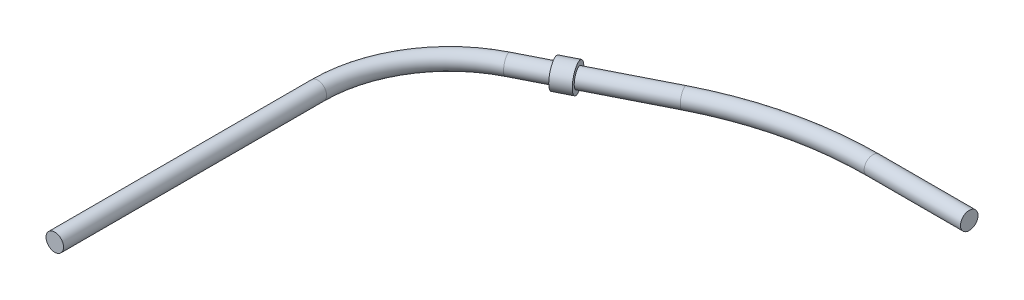
ISO-10303-21;
HEADER;
FILE_DESCRIPTION(('STEP AP214'),'2;1');
FILE_NAME('part.step','',(''),(''),'','','');
FILE_SCHEMA(('AUTOMOTIVE_DESIGN { 1 0 10303 214 1 1 1 1 }'));
ENDSEC;
DATA;
#1=APPLICATION_CONTEXT('core data for automotive mechanical design processes');
#2=APPLICATION_PROTOCOL_DEFINITION('international standard','automotive_design',2000,#1);
#3=PRODUCT_CONTEXT('',#1,'mechanical');
#4=PRODUCT('Part','Part','',(#3));
#5=PRODUCT_RELATED_PRODUCT_CATEGORY('part','',(#4));
#6=PRODUCT_DEFINITION_FORMATION('','',#4);
#7=PRODUCT_DEFINITION_CONTEXT('part definition',#1,'design');
#8=PRODUCT_DEFINITION('design','',#6,#7);
#9=PRODUCT_DEFINITION_SHAPE('','',#8);
#10=(LENGTH_UNIT() NAMED_UNIT(*) SI_UNIT(.MILLI.,.METRE.));
#11=(NAMED_UNIT(*) PLANE_ANGLE_UNIT() SI_UNIT($,.RADIAN.));
#12=(NAMED_UNIT(*) SI_UNIT($,.STERADIAN.) SOLID_ANGLE_UNIT());
#13=UNCERTAINTY_MEASURE_WITH_UNIT(LENGTH_MEASURE(1.E-05),#10,'distance_accuracy_value','');
#14=(GEOMETRIC_REPRESENTATION_CONTEXT(3) GLOBAL_UNCERTAINTY_ASSIGNED_CONTEXT((#13)) GLOBAL_UNIT_ASSIGNED_CONTEXT((#10,
#11,#12)) REPRESENTATION_CONTEXT('',''));
#15=CARTESIAN_POINT('',(0.,0.,0.));
#16=DIRECTION('',(0.,0.,1.));
#17=DIRECTION('',(1.,0.,0.));
#18=AXIS2_PLACEMENT_3D('',#15,#16,#17);
#19=CARTESIAN_POINT('',(0.,0.,0.));
#20=DIRECTION('',(0.,0.,1.));
#21=DIRECTION('',(1.,0.,0.));
#22=AXIS2_PLACEMENT_3D('',#19,#20,#21);
#23=PLANE('',#22);
#24=CARTESIAN_POINT('',(0.,0.,0.));
#25=DIRECTION('',(0.,0.,1.));
#26=DIRECTION('',(1.,0.,0.));
#27=AXIS2_PLACEMENT_3D('',#24,#25,#26);
#28=CIRCLE('',#27,1.);
#29=CARTESIAN_POINT('',(1.,0.,0.));
#30=VERTEX_POINT('',#29);
#31=EDGE_CURVE('E91',#30,#30,#28,.T.);
#32=ORIENTED_EDGE('',*,*,#31,.T.);
#33=EDGE_LOOP('',(#32));
#34=FACE_BOUND('',#33,.T.);
#35=ADVANCED_FACE('F66',(#34),#23,.T.);
#36=CARTESIAN_POINT('',(0.,0.,0.));
#37=DIRECTION('',(0.,0.,-1.));
#38=DIRECTION('',(-1.,0.,0.));
#39=AXIS2_PLACEMENT_3D('',#36,#37,#38);
#40=CYLINDRICAL_SURFACE('',#39,1.);
#41=CARTESIAN_POINT('',(0.,0.,-30.));
#42=DIRECTION('',(0.,0.,1.));
#43=DIRECTION('',(1.,0.,0.));
#44=AXIS2_PLACEMENT_3D('',#41,#42,#43);
#45=CIRCLE('',#44,1.);
#46=CARTESIAN_POINT('',(-0.999999999999997,0.,-30.));
#47=VERTEX_POINT('',#46);
#48=EDGE_CURVE('E88',#47,#47,#45,.T.);
#49=ORIENTED_EDGE('',*,*,#48,.T.);
#50=EDGE_LOOP('',(#49));
#51=FACE_BOUND('',#50,.T.);
#52=ORIENTED_EDGE('',*,*,#31,.F.);
#53=EDGE_LOOP('',(#52));
#54=FACE_BOUND('',#53,.T.);
#55=ADVANCED_FACE('F123',(#51,#54),#40,.T.);
#56=CARTESIAN_POINT('',(15.,0.,-30.));
#57=DIRECTION('',(0.,-1.,0.));
#58=DIRECTION('',(0.,0.,-1.));
#59=AXIS2_PLACEMENT_3D('',#56,#57,#58);
#60=TOROIDAL_SURFACE('',#59,15.,1.);
#61=CARTESIAN_POINT('',(8.23664178129082,0.,-43.3886887186692));
#62=DIRECTION('',(-0.892579247911278,0.,0.450890547913945));
#63=DIRECTION('',(0.450890547913945,0.,0.892579247911278));
#64=AXIS2_PLACEMENT_3D('',#61,#62,#63);
#65=CIRCLE('',#64,1.);
#66=CARTESIAN_POINT('',(7.78575123337688,0.,-44.2812679665804));
#67=VERTEX_POINT('',#66);
#68=EDGE_CURVE('E85',#67,#67,#65,.T.);
#69=CARTESIAN_POINT('',(15.,0.,-30.));
#70=DIRECTION('',(0.,-1.,0.));
#71=DIRECTION('',(0.,0.,-1.));
#72=AXIS2_PLACEMENT_3D('',#69,#70,#71);
#73=CIRCLE('',#72,16.);
#74=EDGE_CURVE('',#47,#67,#73,.T.);
#75=ORIENTED_EDGE('',*,*,#48,.F.);
#76=ORIENTED_EDGE('',*,*,#68,.T.);
#77=ORIENTED_EDGE('',*,*,#74,.T.);
#78=ORIENTED_EDGE('',*,*,#74,.F.);
#79=EDGE_LOOP('',(#75,#77,#76,#78));
#80=FACE_BOUND('',#79,.T.);
#81=ADVANCED_FACE('F119',(#80),#60,.T.);
#82=CARTESIAN_POINT('',(8.23664178129082,0.,-43.3886887186692));
#83=DIRECTION('',(0.892579247911278,0.,-0.450890547913945));
#84=DIRECTION('',(-0.450890547913945,0.,-0.892579247911278));
#85=AXIS2_PLACEMENT_3D('',#82,#83,#84);
#86=CYLINDRICAL_SURFACE('',#85,1.);
#87=CARTESIAN_POINT('',(11.8069587729359,0.,-45.192250910325));
#88=DIRECTION('',(-0.892579247911278,0.,0.450890547913945));
#89=DIRECTION('',(0.450890547913945,0.,0.892579247911278));
#90=AXIS2_PLACEMENT_3D('',#87,#88,#89);
#91=CIRCLE('',#90,0.999999999999999);
#92=CARTESIAN_POINT('',(12.2578493208499,0.,-44.2996716624137));
#93=VERTEX_POINT('',#92);
#94=EDGE_CURVE('E98',#93,#93,#91,.T.);
#95=ORIENTED_EDGE('',*,*,#94,.T.);
#96=EDGE_LOOP('',(#95));
#97=FACE_BOUND('',#96,.T.);
#98=ORIENTED_EDGE('',*,*,#68,.F.);
#99=EDGE_LOOP('',(#98));
#100=FACE_BOUND('',#99,.T.);
#101=ADVANCED_FACE('F104',(#97,#100),#86,.T.);
#102=CARTESIAN_POINT('',(11.8069587729359,0.,-45.192250910325));
#103=DIRECTION('',(-0.892579247911278,0.,0.450890547913945));
#104=DIRECTION('',(0.450890547913945,0.,0.892579247911278));
#105=AXIS2_PLACEMENT_3D('',#102,#103,#104);
#106=PLANE('',#105);
#107=CARTESIAN_POINT('',(11.8069587729359,0.,-45.192250910325));
#108=DIRECTION('',(-0.892579247911278,0.,0.450890547913945));
#109=DIRECTION('',(0.450890547913945,0.,0.892579247911278));
#110=AXIS2_PLACEMENT_3D('',#107,#108,#109);
#111=CIRCLE('',#110,1.5);
#112=CARTESIAN_POINT('',(12.4832945948068,0.,-43.853382038458));
#113=VERTEX_POINT('',#112);
#114=EDGE_CURVE('E94',#113,#113,#111,.T.);
#115=ORIENTED_EDGE('',*,*,#114,.T.);
#116=EDGE_LOOP('',(#115));
#117=FACE_BOUND('',#116,.T.);
#118=ORIENTED_EDGE('',*,*,#94,.F.);
#119=EDGE_LOOP('',(#118));
#120=FACE_BOUND('',#119,.T.);
#121=ADVANCED_FACE('F107',(#117,#120),#106,.T.);
#122=CARTESIAN_POINT('',(13.5921172687585,0.,-46.0940320061528));
#123=DIRECTION('',(-0.892579247911278,0.,0.450890547913945));
#124=DIRECTION('',(0.450890547913945,0.,0.892579247911278));
#125=AXIS2_PLACEMENT_3D('',#122,#123,#124);
#126=PLANE('',#125);
#127=CARTESIAN_POINT('',(13.5921172687585,0.,-46.0940320061528));
#128=DIRECTION('',(-0.892579247911278,0.,0.450890547913945));
#129=DIRECTION('',(0.450890547913945,0.,0.892579247911278));
#130=AXIS2_PLACEMENT_3D('',#127,#128,#129);
#131=CIRCLE('',#130,1.5);
#132=CARTESIAN_POINT('',(14.2684530906294,0.,-44.7551631342859));
#133=VERTEX_POINT('',#132);
#134=EDGE_CURVE('E95',#133,#133,#131,.T.);
#135=ORIENTED_EDGE('',*,*,#134,.F.);
#136=EDGE_LOOP('',(#135));
#137=FACE_BOUND('',#136,.T.);
#138=CARTESIAN_POINT('',(13.5921172687585,0.,-46.0940320061528));
#139=DIRECTION('',(-0.892579247911278,0.,0.450890547913945));
#140=DIRECTION('',(0.450890547913945,0.,0.892579247911278));
#141=AXIS2_PLACEMENT_3D('',#138,#139,#140);
#142=CIRCLE('',#141,1.);
#143=CARTESIAN_POINT('',(14.0430078166724,0.,-45.2014527582416));
#144=VERTEX_POINT('',#143);
#145=EDGE_CURVE('E48',#144,#144,#142,.T.);
#146=ORIENTED_EDGE('',*,*,#145,.T.);
#147=EDGE_LOOP('',(#146));
#148=FACE_BOUND('',#147,.T.);
#149=ADVANCED_FACE('F109',(#137,#148),#126,.F.);
#150=CARTESIAN_POINT('',(11.8069587729359,0.,-45.192250910325));
#151=DIRECTION('',(0.892579247911278,0.,-0.450890547913945));
#152=DIRECTION('',(-0.450890547913945,0.,-0.892579247911278));
#153=AXIS2_PLACEMENT_3D('',#150,#151,#152);
#154=CYLINDRICAL_SURFACE('',#153,1.5);
#155=ORIENTED_EDGE('',*,*,#114,.F.);
#156=EDGE_LOOP('',(#155));
#157=FACE_BOUND('',#156,.T.);
#158=ORIENTED_EDGE('',*,*,#134,.T.);
#159=EDGE_LOOP('',(#158));
#160=FACE_BOUND('',#159,.T.);
#161=ADVANCED_FACE('F116',(#157,#160),#154,.T.);
#162=CARTESIAN_POINT('',(50.,0.,-54.2948844804166));
#163=DIRECTION('',(-1.,0.,0.));
#164=DIRECTION('',(0.,0.,1.));
#165=AXIS2_PLACEMENT_3D('',#162,#163,#164);
#166=PLANE('',#165);
#167=CARTESIAN_POINT('',(50.,0.,-54.2948844804166));
#168=DIRECTION('',(-1.,0.,0.));
#169=DIRECTION('',(0.,0.,1.));
#170=AXIS2_PLACEMENT_3D('',#167,#168,#169);
#171=CIRCLE('',#170,1.);
#172=CARTESIAN_POINT('',(50.,0.,-53.2948844804166));
#173=VERTEX_POINT('',#172);
#174=EDGE_CURVE('E72',#173,#173,#171,.T.);
#175=ORIENTED_EDGE('',*,*,#174,.F.);
#176=EDGE_LOOP('',(#175));
#177=FACE_BOUND('',#176,.T.);
#178=ADVANCED_FACE('F145',(#177),#166,.F.);
#179=CARTESIAN_POINT('',(39.0145802806373,0.,-54.2948844804166));
#180=DIRECTION('',(1.,0.,0.));
#181=DIRECTION('',(0.,0.,-1.));
#182=AXIS2_PLACEMENT_3D('',#179,#180,#181);
#183=CYLINDRICAL_SURFACE('',#182,1.);
#184=ORIENTED_EDGE('',*,*,#174,.T.);
#185=EDGE_LOOP('',(#184));
#186=FACE_BOUND('',#185,.T.);
#187=CARTESIAN_POINT('',(39.0145802806373,0.,-54.2948844804166));
#188=DIRECTION('',(-1.,0.,0.));
#189=DIRECTION('',(0.,0.,1.));
#190=AXIS2_PLACEMENT_3D('',#187,#188,#189);
#191=CIRCLE('',#190,1.);
#192=CARTESIAN_POINT('',(39.0145802806373,0.,-55.2948844804166));
#193=VERTEX_POINT('',#192);
#194=EDGE_CURVE('E76',#193,#193,#191,.T.);
#195=ORIENTED_EDGE('',*,*,#194,.F.);
#196=EDGE_LOOP('',(#195));
#197=FACE_BOUND('',#196,.T.);
#198=ADVANCED_FACE('F142',(#186,#197),#183,.T.);
#199=CARTESIAN_POINT('',(39.0145802806373,0.,-15.728430024609));
#200=DIRECTION('',(0.,-1.,0.));
#201=DIRECTION('',(0.,0.,-1.));
#202=AXIS2_PLACEMENT_3D('',#199,#200,#201);
#203=TOROIDAL_SURFACE('',#202,38.5664544558076,1.);
#204=CARTESIAN_POINT('',(21.62533049996,0.,-50.1520469373783));
#205=DIRECTION('',(-0.892579247911278,0.,0.450890547913945));
#206=DIRECTION('',(0.450890547913945,0.,0.892579247911278));
#207=AXIS2_PLACEMENT_3D('',#204,#205,#206);
#208=CIRCLE('',#207,1.);
#209=CARTESIAN_POINT('',(21.1744399520461,0.,-51.0446261852896));
#210=VERTEX_POINT('',#209);
#211=EDGE_CURVE('E80',#210,#210,#208,.T.);
#212=CARTESIAN_POINT('',(39.0145802806373,0.,-15.728430024609));
#213=DIRECTION('',(0.,-1.,0.));
#214=DIRECTION('',(0.,0.,-1.));
#215=AXIS2_PLACEMENT_3D('',#212,#213,#214);
#216=CIRCLE('',#215,39.5664544558076);
#217=EDGE_CURVE('',#210,#193,#216,.T.);
#218=ORIENTED_EDGE('',*,*,#211,.F.);
#219=ORIENTED_EDGE('',*,*,#194,.T.);
#220=ORIENTED_EDGE('',*,*,#217,.T.);
#221=ORIENTED_EDGE('',*,*,#217,.F.);
#222=EDGE_LOOP('',(#218,#220,#219,#221));
#223=FACE_BOUND('',#222,.T.);
#224=ADVANCED_FACE('F139',(#223),#203,.T.);
#225=ORIENTED_EDGE('',*,*,#211,.T.);
#226=EDGE_LOOP('',(#225));
#227=FACE_BOUND('',#226,.T.);
#228=ORIENTED_EDGE('',*,*,#145,.F.);
#229=EDGE_LOOP('',(#228));
#230=FACE_BOUND('',#229,.T.);
#231=ADVANCED_FACE('F121',(#227,#230),#86,.T.);
#232=CLOSED_SHELL('',(#35,#55,#81,#101,#121,#149,#161,#178,#198,#224,#231));
#233=MANIFOLD_SOLID_BREP('B7',#232);
#234=ADVANCED_BREP_SHAPE_REPRESENTATION('',(#18,#233),#14);
#235=SHAPE_DEFINITION_REPRESENTATION(#9,#234);
ENDSEC;
END-ISO-10303-21;
